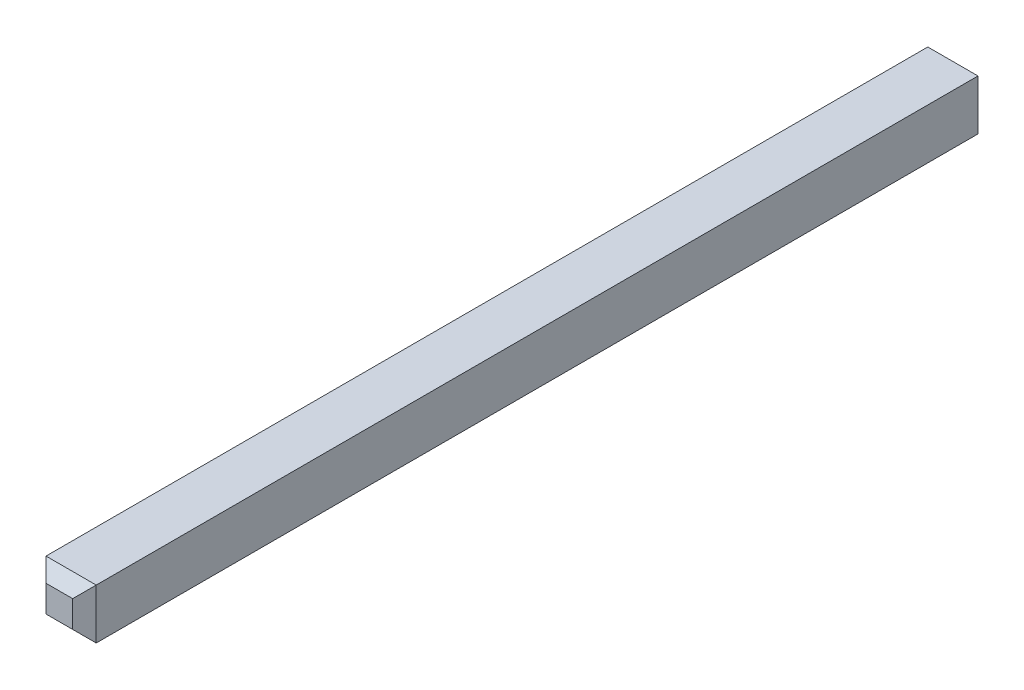
ISO-10303-21;
HEADER;
FILE_DESCRIPTION(('STEP AP214'),'2;1');
FILE_NAME('part.step','',(''),(''),'','','');
FILE_SCHEMA(('AUTOMOTIVE_DESIGN { 1 0 10303 214 1 1 1 1 }'));
ENDSEC;
DATA;
#1=APPLICATION_CONTEXT('core data for automotive mechanical design processes');
#2=APPLICATION_PROTOCOL_DEFINITION('international standard','automotive_design',2000,#1);
#3=PRODUCT_CONTEXT('',#1,'mechanical');
#4=PRODUCT('Part','Part','',(#3));
#5=PRODUCT_RELATED_PRODUCT_CATEGORY('part','',(#4));
#6=PRODUCT_DEFINITION_FORMATION('','',#4);
#7=PRODUCT_DEFINITION_CONTEXT('part definition',#1,'design');
#8=PRODUCT_DEFINITION('design','',#6,#7);
#9=PRODUCT_DEFINITION_SHAPE('','',#8);
#10=(LENGTH_UNIT() NAMED_UNIT(*) SI_UNIT(.MILLI.,.METRE.));
#11=(NAMED_UNIT(*) PLANE_ANGLE_UNIT() SI_UNIT($,.RADIAN.));
#12=(NAMED_UNIT(*) SI_UNIT($,.STERADIAN.) SOLID_ANGLE_UNIT());
#13=UNCERTAINTY_MEASURE_WITH_UNIT(LENGTH_MEASURE(1.E-05),#10,'distance_accuracy_value','');
#14=(GEOMETRIC_REPRESENTATION_CONTEXT(3) GLOBAL_UNCERTAINTY_ASSIGNED_CONTEXT((#13)) GLOBAL_UNIT_ASSIGNED_CONTEXT((#10,
#11,#12)) REPRESENTATION_CONTEXT('',''));
#15=CARTESIAN_POINT('',(0.,0.,0.));
#16=DIRECTION('',(0.,0.,1.));
#17=DIRECTION('',(1.,0.,0.));
#18=AXIS2_PLACEMENT_3D('',#15,#16,#17);
#19=CARTESIAN_POINT('',(0.32,-0.32,0.15));
#20=DIRECTION('',(0.,0.707106781186548,0.707106781186548));
#21=DIRECTION('',(1.,0.,0.));
#22=AXIS2_PLACEMENT_3D('',#19,#20,#21);
#23=PLANE('',#22);
#24=DIRECTION('',(0.577350269189626,0.577350269189626,-0.577350269189626));
#25=VECTOR('',#24,1.);
#26=CARTESIAN_POINT('',(-0.32,-0.32,0.15));
#27=LINE('',#26,#25);
#28=CARTESIAN_POINT('',(-0.32,-0.32,0.15));
#29=VERTEX_POINT('',#28);
#30=CARTESIAN_POINT('',(-0.17,-0.17,0.));
#31=VERTEX_POINT('',#30);
#32=EDGE_CURVE('E26',#29,#31,#27,.T.);
#33=ORIENTED_EDGE('',*,*,#32,.T.);
#34=DIRECTION('',(-1.,0.,0.));
#35=VECTOR('',#34,1.);
#36=CARTESIAN_POINT('',(-0.32,-0.17,0.));
#37=LINE('',#36,#35);
#38=CARTESIAN_POINT('',(0.17,-0.17,0.));
#39=VERTEX_POINT('',#38);
#40=EDGE_CURVE('E158',#39,#31,#37,.T.);
#41=ORIENTED_EDGE('',*,*,#40,.F.);
#42=DIRECTION('',(0.577350269189626,-0.577350269189626,0.577350269189626));
#43=VECTOR('',#42,1.);
#44=CARTESIAN_POINT('',(0.32,-0.32,0.15));
#45=LINE('',#44,#43);
#46=CARTESIAN_POINT('',(0.32,-0.32,0.15));
#47=VERTEX_POINT('',#46);
#48=EDGE_CURVE('E11',#39,#47,#45,.T.);
#49=ORIENTED_EDGE('',*,*,#48,.T.);
#50=DIRECTION('',(1.,0.,0.));
#51=VECTOR('',#50,1.);
#52=CARTESIAN_POINT('',(0.32,-0.32,0.15));
#53=LINE('',#52,#51);
#54=EDGE_CURVE('E193',#29,#47,#53,.T.);
#55=ORIENTED_EDGE('',*,*,#54,.F.);
#56=EDGE_LOOP('',(#33,#41,#49,#55));
#57=FACE_BOUND('',#56,.T.);
#58=ADVANCED_FACE('F17',(#57),#23,.F.);
#59=CARTESIAN_POINT('',(0.32,-0.32,0.15));
#60=DIRECTION('',(-0.707106781186548,0.,0.707106781186548));
#61=DIRECTION('',(0.,1.,0.));
#62=AXIS2_PLACEMENT_3D('',#59,#60,#61);
#63=PLANE('',#62);
#64=DIRECTION('',(0.577350269189626,0.577350269189626,0.577350269189626));
#65=VECTOR('',#64,1.);
#66=CARTESIAN_POINT('',(0.32,0.32,0.15));
#67=LINE('',#66,#65);
#68=CARTESIAN_POINT('',(0.17,0.17,0.));
#69=VERTEX_POINT('',#68);
#70=CARTESIAN_POINT('',(0.32,0.32,0.15));
#71=VERTEX_POINT('',#70);
#72=EDGE_CURVE('E88',#69,#71,#67,.T.);
#73=ORIENTED_EDGE('',*,*,#72,.T.);
#74=DIRECTION('',(0.,1.,0.));
#75=VECTOR('',#74,1.);
#76=CARTESIAN_POINT('',(0.32,-0.32,0.15));
#77=LINE('',#76,#75);
#78=EDGE_CURVE('E202',#47,#71,#77,.T.);
#79=ORIENTED_EDGE('',*,*,#78,.F.);
#80=ORIENTED_EDGE('',*,*,#48,.F.);
#81=DIRECTION('',(0.,-1.,0.));
#82=VECTOR('',#81,1.);
#83=CARTESIAN_POINT('',(0.17,0.32,0.));
#84=LINE('',#83,#82);
#85=EDGE_CURVE('E136',#69,#39,#84,.T.);
#86=ORIENTED_EDGE('',*,*,#85,.F.);
#87=EDGE_LOOP('',(#73,#79,#80,#86));
#88=FACE_BOUND('',#87,.T.);
#89=ADVANCED_FACE('F19',(#88),#63,.F.);
#90=CARTESIAN_POINT('',(-0.32,-0.32,0.15));
#91=DIRECTION('',(0.707106781186548,0.,0.707106781186548));
#92=DIRECTION('',(0.,-1.,0.));
#93=AXIS2_PLACEMENT_3D('',#90,#91,#92);
#94=PLANE('',#93);
#95=DIRECTION('',(0.577350269189626,-0.577350269189626,-0.577350269189626));
#96=VECTOR('',#95,1.);
#97=CARTESIAN_POINT('',(-0.106666666667,0.106666666667,-0.06333333333333));
#98=LINE('',#97,#96);
#99=CARTESIAN_POINT('',(-0.32,0.32,0.15));
#100=VERTEX_POINT('',#99);
#101=CARTESIAN_POINT('',(-0.17,0.17,0.));
#102=VERTEX_POINT('',#101);
#103=EDGE_CURVE('E38',#100,#102,#98,.T.);
#104=ORIENTED_EDGE('',*,*,#103,.T.);
#105=DIRECTION('',(0.,1.,0.));
#106=VECTOR('',#105,1.);
#107=CARTESIAN_POINT('',(-0.17,0.32,0.));
#108=LINE('',#107,#106);
#109=EDGE_CURVE('E162',#31,#102,#108,.T.);
#110=ORIENTED_EDGE('',*,*,#109,.F.);
#111=ORIENTED_EDGE('',*,*,#32,.F.);
#112=DIRECTION('',(0.,-1.,0.));
#113=VECTOR('',#112,1.);
#114=CARTESIAN_POINT('',(-0.32,-0.32,0.15));
#115=LINE('',#114,#113);
#116=EDGE_CURVE('E186',#100,#29,#115,.T.);
#117=ORIENTED_EDGE('',*,*,#116,.F.);
#118=EDGE_LOOP('',(#104,#110,#111,#117));
#119=FACE_BOUND('',#118,.T.);
#120=ADVANCED_FACE('F234',(#119),#94,.F.);
#121=CARTESIAN_POINT('',(0.32,0.32,0.15));
#122=DIRECTION('',(0.,-0.707106781186548,0.707106781186548));
#123=DIRECTION('',(-1.,0.,0.));
#124=AXIS2_PLACEMENT_3D('',#121,#122,#123);
#125=PLANE('',#124);
#126=ORIENTED_EDGE('',*,*,#72,.F.);
#127=DIRECTION('',(1.,0.,0.));
#128=VECTOR('',#127,1.);
#129=CARTESIAN_POINT('',(-0.32,0.17,0.));
#130=LINE('',#129,#128);
#131=EDGE_CURVE('E166',#102,#69,#130,.T.);
#132=ORIENTED_EDGE('',*,*,#131,.F.);
#133=ORIENTED_EDGE('',*,*,#103,.F.);
#134=DIRECTION('',(-1.,0.,0.));
#135=VECTOR('',#134,1.);
#136=CARTESIAN_POINT('',(0.32,0.32,0.15));
#137=LINE('',#136,#135);
#138=EDGE_CURVE('E151',#71,#100,#137,.T.);
#139=ORIENTED_EDGE('',*,*,#138,.F.);
#140=EDGE_LOOP('',(#126,#132,#133,#139));
#141=FACE_BOUND('',#140,.T.);
#142=ADVANCED_FACE('F253',(#141),#125,.F.);
#143=CARTESIAN_POINT('',(0.17,0.32,11.54));
#144=DIRECTION('',(0.707106781186548,0.,0.707106781186548));
#145=DIRECTION('',(0.,-1.,0.));
#146=AXIS2_PLACEMENT_3D('',#143,#144,#145);
#147=PLANE('',#146);
#148=DIRECTION('',(0.577350269189626,-0.577350269189626,-0.577350269189626));
#149=VECTOR('',#148,1.);
#150=CARTESIAN_POINT('',(0.006666666666665,-0.006666666666666,11.703333333333));
#151=LINE('',#150,#149);
#152=CARTESIAN_POINT('',(0.17,-0.17,11.54));
#153=VERTEX_POINT('',#152);
#154=CARTESIAN_POINT('',(0.32,-0.32,11.39));
#155=VERTEX_POINT('',#154);
#156=EDGE_CURVE('E127',#153,#155,#151,.T.);
#157=ORIENTED_EDGE('',*,*,#156,.T.);
#158=DIRECTION('',(0.,-1.,0.));
#159=VECTOR('',#158,1.);
#160=CARTESIAN_POINT('',(0.32,-0.32,11.39));
#161=LINE('',#160,#159);
#162=CARTESIAN_POINT('',(0.32,0.32,11.39));
#163=VERTEX_POINT('',#162);
#164=EDGE_CURVE('E201',#163,#155,#161,.T.);
#165=ORIENTED_EDGE('',*,*,#164,.F.);
#166=DIRECTION('',(-0.577350269189626,-0.577350269189626,0.577350269189626));
#167=VECTOR('',#166,1.);
#168=CARTESIAN_POINT('',(0.006666666666665,0.006666666666668,11.703333333333));
#169=LINE('',#168,#167);
#170=CARTESIAN_POINT('',(0.17,0.17,11.54));
#171=VERTEX_POINT('',#170);
#172=EDGE_CURVE('E171',#163,#171,#169,.T.);
#173=ORIENTED_EDGE('',*,*,#172,.T.);
#174=DIRECTION('',(0.,1.,0.));
#175=VECTOR('',#174,1.);
#176=CARTESIAN_POINT('',(0.17,0.32,11.54));
#177=LINE('',#176,#175);
#178=EDGE_CURVE('E141',#153,#171,#177,.T.);
#179=ORIENTED_EDGE('',*,*,#178,.F.);
#180=EDGE_LOOP('',(#157,#165,#173,#179));
#181=FACE_BOUND('',#180,.T.);
#182=ADVANCED_FACE('F251',(#181),#147,.T.);
#183=CARTESIAN_POINT('',(-0.32,0.17,11.54));
#184=DIRECTION('',(0.,0.707106781186548,0.707106781186548));
#185=DIRECTION('',(1.,0.,0.));
#186=AXIS2_PLACEMENT_3D('',#183,#184,#185);
#187=PLANE('',#186);
#188=DIRECTION('',(0.577350269189626,-0.577350269189626,0.577350269189626));
#189=VECTOR('',#188,1.);
#190=CARTESIAN_POINT('',(-0.22,0.22,11.49));
#191=LINE('',#190,#189);
#192=CARTESIAN_POINT('',(-0.32,0.32,11.39));
#193=VERTEX_POINT('',#192);
#194=CARTESIAN_POINT('',(-0.17,0.17,11.54));
#195=VERTEX_POINT('',#194);
#196=EDGE_CURVE('E100',#193,#195,#191,.T.);
#197=ORIENTED_EDGE('',*,*,#196,.T.);
#198=DIRECTION('',(-1.,0.,0.));
#199=VECTOR('',#198,1.);
#200=CARTESIAN_POINT('',(-0.32,0.17,11.54));
#201=LINE('',#200,#199);
#202=EDGE_CURVE('E134',#171,#195,#201,.T.);
#203=ORIENTED_EDGE('',*,*,#202,.F.);
#204=ORIENTED_EDGE('',*,*,#172,.F.);
#205=DIRECTION('',(1.,0.,0.));
#206=VECTOR('',#205,1.);
#207=CARTESIAN_POINT('',(0.32,0.32,11.39));
#208=LINE('',#207,#206);
#209=EDGE_CURVE('E142',#193,#163,#208,.T.);
#210=ORIENTED_EDGE('',*,*,#209,.F.);
#211=EDGE_LOOP('',(#197,#203,#204,#210));
#212=FACE_BOUND('',#211,.T.);
#213=ADVANCED_FACE('F249',(#212),#187,.T.);
#214=CARTESIAN_POINT('',(-0.32,-0.17,11.54));
#215=DIRECTION('',(0.,-0.707106781186548,0.707106781186548));
#216=DIRECTION('',(-1.,0.,0.));
#217=AXIS2_PLACEMENT_3D('',#214,#215,#216);
#218=PLANE('',#217);
#219=DIRECTION('',(-0.577350269189626,-0.577350269189626,-0.577350269189626));
#220=VECTOR('',#219,1.);
#221=CARTESIAN_POINT('',(-0.006666666666667,-0.006666666666666,11.703333333333));
#222=LINE('',#221,#220);
#223=CARTESIAN_POINT('',(-0.17,-0.17,11.54));
#224=VERTEX_POINT('',#223);
#225=CARTESIAN_POINT('',(-0.32,-0.32,11.39));
#226=VERTEX_POINT('',#225);
#227=EDGE_CURVE('E114',#224,#226,#222,.T.);
#228=ORIENTED_EDGE('',*,*,#227,.T.);
#229=DIRECTION('',(-1.,0.,0.));
#230=VECTOR('',#229,1.);
#231=CARTESIAN_POINT('',(-0.32,-0.32,11.39));
#232=LINE('',#231,#230);
#233=EDGE_CURVE('E207',#155,#226,#232,.T.);
#234=ORIENTED_EDGE('',*,*,#233,.F.);
#235=ORIENTED_EDGE('',*,*,#156,.F.);
#236=DIRECTION('',(1.,0.,0.));
#237=VECTOR('',#236,1.);
#238=CARTESIAN_POINT('',(0.32,-0.17,11.54));
#239=LINE('',#238,#237);
#240=EDGE_CURVE('E133',#224,#153,#239,.T.);
#241=ORIENTED_EDGE('',*,*,#240,.F.);
#242=EDGE_LOOP('',(#228,#234,#235,#241));
#243=FACE_BOUND('',#242,.T.);
#244=ADVANCED_FACE('F138',(#243),#218,.T.);
#245=CARTESIAN_POINT('',(-0.17,0.32,11.54));
#246=DIRECTION('',(-0.707106781186548,0.,0.707106781186548));
#247=DIRECTION('',(0.,1.,0.));
#248=AXIS2_PLACEMENT_3D('',#245,#246,#247);
#249=PLANE('',#248);
#250=ORIENTED_EDGE('',*,*,#196,.F.);
#251=DIRECTION('',(0.,1.,0.));
#252=VECTOR('',#251,1.);
#253=CARTESIAN_POINT('',(-0.32,0.32,11.39));
#254=LINE('',#253,#252);
#255=EDGE_CURVE('E120',#226,#193,#254,.T.);
#256=ORIENTED_EDGE('',*,*,#255,.F.);
#257=ORIENTED_EDGE('',*,*,#227,.F.);
#258=DIRECTION('',(0.,-1.,0.));
#259=VECTOR('',#258,1.);
#260=CARTESIAN_POINT('',(-0.17,-0.32,11.54));
#261=LINE('',#260,#259);
#262=EDGE_CURVE('E117',#195,#224,#261,.T.);
#263=ORIENTED_EDGE('',*,*,#262,.F.);
#264=EDGE_LOOP('',(#250,#256,#257,#263));
#265=FACE_BOUND('',#264,.T.);
#266=ADVANCED_FACE('F116',(#265),#249,.T.);
#267=CARTESIAN_POINT('',(-0.32,0.32,0.));
#268=DIRECTION('',(0.,0.,1.));
#269=DIRECTION('',(1.,0.,0.));
#270=AXIS2_PLACEMENT_3D('',#267,#268,#269);
#271=PLANE('',#270);
#272=ORIENTED_EDGE('',*,*,#85,.T.);
#273=ORIENTED_EDGE('',*,*,#40,.T.);
#274=ORIENTED_EDGE('',*,*,#109,.T.);
#275=ORIENTED_EDGE('',*,*,#131,.T.);
#276=EDGE_LOOP('',(#272,#273,#274,#275));
#277=FACE_BOUND('',#276,.T.);
#278=ADVANCED_FACE('F225',(#277),#271,.F.);
#279=CARTESIAN_POINT('',(-0.32,0.32,11.54));
#280=DIRECTION('',(0.,0.,1.));
#281=DIRECTION('',(1.,0.,0.));
#282=AXIS2_PLACEMENT_3D('',#279,#280,#281);
#283=PLANE('',#282);
#284=ORIENTED_EDGE('',*,*,#240,.T.);
#285=ORIENTED_EDGE('',*,*,#178,.T.);
#286=ORIENTED_EDGE('',*,*,#202,.T.);
#287=ORIENTED_EDGE('',*,*,#262,.T.);
#288=EDGE_LOOP('',(#284,#285,#286,#287));
#289=FACE_BOUND('',#288,.T.);
#290=ADVANCED_FACE('F131',(#289),#283,.T.);
#291=CARTESIAN_POINT('',(0.32,0.32,11.54));
#292=DIRECTION('',(0.,-1.,0.));
#293=DIRECTION('',(0.,0.,-1.));
#294=AXIS2_PLACEMENT_3D('',#291,#292,#293);
#295=PLANE('',#294);
#296=DIRECTION('',(0.,0.,-1.));
#297=VECTOR('',#296,1.);
#298=CARTESIAN_POINT('',(0.32,0.32,11.54));
#299=LINE('',#298,#297);
#300=EDGE_CURVE('E198',#163,#71,#299,.T.);
#301=ORIENTED_EDGE('',*,*,#300,.T.);
#302=ORIENTED_EDGE('',*,*,#138,.T.);
#303=DIRECTION('',(0.,0.,-1.));
#304=VECTOR('',#303,1.);
#305=CARTESIAN_POINT('',(-0.32,0.32,11.54));
#306=LINE('',#305,#304);
#307=EDGE_CURVE('E190',#193,#100,#306,.T.);
#308=ORIENTED_EDGE('',*,*,#307,.F.);
#309=ORIENTED_EDGE('',*,*,#209,.T.);
#310=EDGE_LOOP('',(#301,#302,#308,#309));
#311=FACE_BOUND('',#310,.T.);
#312=ADVANCED_FACE('F239',(#311),#295,.F.);
#313=CARTESIAN_POINT('',(0.32,-0.32,11.54));
#314=DIRECTION('',(-1.,0.,0.));
#315=DIRECTION('',(0.,0.,1.));
#316=AXIS2_PLACEMENT_3D('',#313,#314,#315);
#317=PLANE('',#316);
#318=DIRECTION('',(0.,0.,-1.));
#319=VECTOR('',#318,1.);
#320=CARTESIAN_POINT('',(0.32,-0.32,11.54));
#321=LINE('',#320,#319);
#322=EDGE_CURVE('E197',#155,#47,#321,.T.);
#323=ORIENTED_EDGE('',*,*,#322,.T.);
#324=ORIENTED_EDGE('',*,*,#78,.T.);
#325=ORIENTED_EDGE('',*,*,#300,.F.);
#326=ORIENTED_EDGE('',*,*,#164,.T.);
#327=EDGE_LOOP('',(#323,#324,#325,#326));
#328=FACE_BOUND('',#327,.T.);
#329=ADVANCED_FACE('F237',(#328),#317,.F.);
#330=CARTESIAN_POINT('',(0.32,-0.32,11.54));
#331=DIRECTION('',(0.,1.,0.));
#332=DIRECTION('',(1.,0.,0.));
#333=AXIS2_PLACEMENT_3D('',#330,#331,#332);
#334=PLANE('',#333);
#335=DIRECTION('',(0.,0.,-1.));
#336=VECTOR('',#335,1.);
#337=CARTESIAN_POINT('',(-0.32,-0.32,11.54));
#338=LINE('',#337,#336);
#339=EDGE_CURVE('E184',#226,#29,#338,.T.);
#340=ORIENTED_EDGE('',*,*,#339,.T.);
#341=ORIENTED_EDGE('',*,*,#54,.T.);
#342=ORIENTED_EDGE('',*,*,#322,.F.);
#343=ORIENTED_EDGE('',*,*,#233,.T.);
#344=EDGE_LOOP('',(#340,#341,#342,#343));
#345=FACE_BOUND('',#344,.T.);
#346=ADVANCED_FACE('F264',(#345),#334,.F.);
#347=CARTESIAN_POINT('',(-0.32,-0.32,11.54));
#348=DIRECTION('',(1.,0.,0.));
#349=DIRECTION('',(0.,1.,0.));
#350=AXIS2_PLACEMENT_3D('',#347,#348,#349);
#351=PLANE('',#350);
#352=ORIENTED_EDGE('',*,*,#307,.T.);
#353=ORIENTED_EDGE('',*,*,#116,.T.);
#354=ORIENTED_EDGE('',*,*,#339,.F.);
#355=ORIENTED_EDGE('',*,*,#255,.T.);
#356=EDGE_LOOP('',(#352,#353,#354,#355));
#357=FACE_BOUND('',#356,.T.);
#358=ADVANCED_FACE('F269',(#357),#351,.F.);
#359=CLOSED_SHELL('',(#58,#89,#120,#142,#182,#213,#244,#266,#278,#290,#312,#329,#346,#358));
#360=MANIFOLD_SOLID_BREP('B1',#359);
#361=ADVANCED_BREP_SHAPE_REPRESENTATION('',(#18,#360),#14);
#362=SHAPE_DEFINITION_REPRESENTATION(#9,#361);
ENDSEC;
END-ISO-10303-21;
